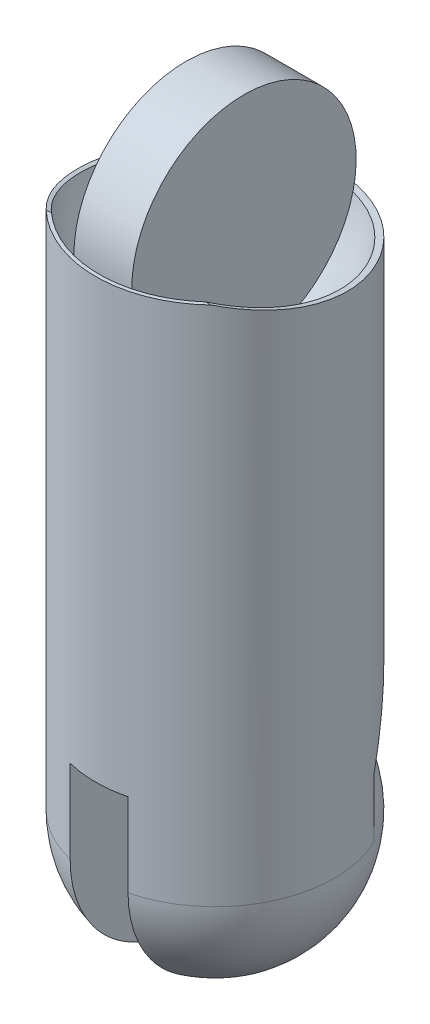
ISO-10303-21;
HEADER;
FILE_DESCRIPTION(('STEP AP214'),'2;1');
FILE_NAME('part.step','',(''),(''),'','','');
FILE_SCHEMA(('AUTOMOTIVE_DESIGN { 1 0 10303 214 1 1 1 1 }'));
ENDSEC;
DATA;
#1=APPLICATION_CONTEXT('core data for automotive mechanical design processes');
#2=APPLICATION_PROTOCOL_DEFINITION('international standard','automotive_design',2000,#1);
#3=PRODUCT_CONTEXT('',#1,'mechanical');
#4=PRODUCT('Part','Part','',(#3));
#5=PRODUCT_RELATED_PRODUCT_CATEGORY('part','',(#4));
#6=PRODUCT_DEFINITION_FORMATION('','',#4);
#7=PRODUCT_DEFINITION_CONTEXT('part definition',#1,'design');
#8=PRODUCT_DEFINITION('design','',#6,#7);
#9=PRODUCT_DEFINITION_SHAPE('','',#8);
#10=(LENGTH_UNIT() NAMED_UNIT(*) SI_UNIT(.MILLI.,.METRE.));
#11=(NAMED_UNIT(*) PLANE_ANGLE_UNIT() SI_UNIT($,.RADIAN.));
#12=(NAMED_UNIT(*) SI_UNIT($,.STERADIAN.) SOLID_ANGLE_UNIT());
#13=UNCERTAINTY_MEASURE_WITH_UNIT(LENGTH_MEASURE(1.E-05),#10,'distance_accuracy_value','');
#14=(GEOMETRIC_REPRESENTATION_CONTEXT(3) GLOBAL_UNCERTAINTY_ASSIGNED_CONTEXT((#13)) GLOBAL_UNIT_ASSIGNED_CONTEXT((#10,
#11,#12)) REPRESENTATION_CONTEXT('',''));
#15=CARTESIAN_POINT('',(0.,0.,0.));
#16=DIRECTION('',(0.,0.,1.));
#17=DIRECTION('',(1.,0.,0.));
#18=AXIS2_PLACEMENT_3D('',#15,#16,#17);
#19=CARTESIAN_POINT('',(0.,36.,0.));
#20=DIRECTION('',(0.,1.,0.));
#21=DIRECTION('',(0.,0.,1.));
#22=AXIS2_PLACEMENT_3D('',#19,#20,#21);
#23=PLANE('',#22);
#24=DIRECTION('',(0.,0.,-1.));
#25=VECTOR('',#24,1.);
#26=CARTESIAN_POINT('',(2.,36.,0.));
#27=LINE('',#26,#25);
#28=CARTESIAN_POINT('',(2.,36.,7.75));
#29=VERTEX_POINT('',#28);
#30=CARTESIAN_POINT('',(2.,36.,7.74596669241483));
#31=VERTEX_POINT('',#30);
#32=EDGE_CURVE('E174',#29,#31,#27,.T.);
#33=ORIENTED_EDGE('',*,*,#32,.F.);
#34=DIRECTION('',(-1.,0.,0.));
#35=VECTOR('',#34,1.);
#36=CARTESIAN_POINT('',(2.,36.,7.75));
#37=LINE('',#36,#35);
#38=CARTESIAN_POINT('',(1.98431348329844,36.,7.75));
#39=VERTEX_POINT('',#38);
#40=EDGE_CURVE('E180',#29,#39,#37,.T.);
#41=ORIENTED_EDGE('',*,*,#40,.T.);
#42=CARTESIAN_POINT('',(0.,36.,0.));
#43=DIRECTION('',(0.,1.,0.));
#44=DIRECTION('',(0.,0.,1.));
#45=AXIS2_PLACEMENT_3D('',#42,#43,#44);
#46=CIRCLE('',#45,8.);
#47=CARTESIAN_POINT('',(-1.98431348329844,36.,7.75));
#48=VERTEX_POINT('',#47);
#49=EDGE_CURVE('E277',#39,#48,#46,.F.);
#50=ORIENTED_EDGE('',*,*,#49,.T.);
#51=CARTESIAN_POINT('',(-2.,36.,7.75));
#52=VERTEX_POINT('',#51);
#53=EDGE_CURVE('E62',#48,#52,#37,.T.);
#54=ORIENTED_EDGE('',*,*,#53,.T.);
#55=DIRECTION('',(0.,0.,-1.));
#56=VECTOR('',#55,1.);
#57=CARTESIAN_POINT('',(-2.,36.,0.));
#58=LINE('',#57,#56);
#59=CARTESIAN_POINT('',(-2.,36.,7.74596669241483));
#60=VERTEX_POINT('',#59);
#61=EDGE_CURVE('E170',#52,#60,#58,.T.);
#62=ORIENTED_EDGE('',*,*,#61,.T.);
#63=CARTESIAN_POINT('',(-5.3215642080525,36.,5.97335369617224));
#64=VERTEX_POINT('',#63);
#65=EDGE_CURVE('E278',#60,#64,#46,.F.);
#66=ORIENTED_EDGE('',*,*,#65,.T.);
#67=DIRECTION('',(1.,0.,0.));
#68=VECTOR('',#67,1.);
#69=CARTESIAN_POINT('',(-15.,36.,5.97335369617224));
#70=LINE('',#69,#68);
#71=CARTESIAN_POINT('',(-5.69047850540053,36.,5.97335369617224));
#72=VERTEX_POINT('',#71);
#73=EDGE_CURVE('E286',#72,#64,#70,.T.);
#74=ORIENTED_EDGE('',*,*,#73,.F.);
#75=CARTESIAN_POINT('',(0.,36.,0.));
#76=DIRECTION('',(0.,1.,0.));
#77=DIRECTION('',(0.,0.,1.));
#78=AXIS2_PLACEMENT_3D('',#75,#76,#77);
#79=CIRCLE('',#78,8.25);
#80=CARTESIAN_POINT('',(5.69047850540053,36.,5.97335369617224));
#81=VERTEX_POINT('',#80);
#82=EDGE_CURVE('E264',#72,#81,#79,.T.);
#83=ORIENTED_EDGE('',*,*,#82,.T.);
#84=CARTESIAN_POINT('',(5.3215642080525,36.,5.97335369617224));
#85=VERTEX_POINT('',#84);
#86=EDGE_CURVE('E187',#85,#81,#70,.T.);
#87=ORIENTED_EDGE('',*,*,#86,.F.);
#88=EDGE_CURVE('E274',#85,#31,#46,.F.);
#89=ORIENTED_EDGE('',*,*,#88,.T.);
#90=EDGE_LOOP('',(#33,#41,#50,#54,#62,#66,#74,#83,#87,#89));
#91=FACE_BOUND('',#90,.T.);
#92=ADVANCED_FACE('F38',(#91),#23,.T.);
#93=CARTESIAN_POINT('',(0.,36.,0.));
#94=DIRECTION('',(-1.,0.,0.));
#95=DIRECTION('',(0.,0.,-1.));
#96=AXIS2_PLACEMENT_3D('',#93,#94,#95);
#97=SPHERICAL_SURFACE('',#96,8.);
#98=CARTESIAN_POINT('',(-5.3215642080525,36.,5.97335369617224));
#99=CARTESIAN_POINT('',(-5.48614232672843,35.9554743726382,5.82676601396653));
#100=CARTESIAN_POINT('',(-5.64422779175355,35.9099547395393,5.67320395136296));
#101=CARTESIAN_POINT('',(-5.94643271531232,35.8177724982267,5.35323956337665));
#102=CARTESIAN_POINT('',(-6.09055318311453,35.7711099729172,5.18683816747294));
#103=CARTESIAN_POINT('',(-6.36377455277162,35.6775135101912,4.84240430487822));
#104=CARTESIAN_POINT('',(-6.49288603709173,35.6305797887997,4.66438017310098));
#105=CARTESIAN_POINT('',(-6.73536791141526,35.5371872758285,4.29780068972347));
#106=CARTESIAN_POINT('',(-6.84873839025181,35.4907284815698,4.1092453975634));
#107=CARTESIAN_POINT('',(-7.05903541360741,35.3989755548127,3.72280865631633));
#108=CARTESIAN_POINT('',(-7.15595559529589,35.3536818786929,3.52492363621524));
#109=CARTESIAN_POINT('',(-7.3326608468633,35.2648947416569,3.12125293679665));
#110=CARTESIAN_POINT('',(-7.41244565399105,35.2214013083535,2.91546713638684));
#111=CARTESIAN_POINT('',(-7.5543303535871,35.1367389099754,2.49747221284557));
#112=CARTESIAN_POINT('',(-7.61643394122213,35.0955694606593,2.28526444210111));
#113=CARTESIAN_POINT('',(-7.72255535633911,35.0159486498448,1.85587591813577));
#114=CARTESIAN_POINT('',(-7.76657325095335,34.9774972782574,1.6386951833772));
#115=CARTESIAN_POINT('',(-7.83623132404941,34.9035831785807,1.20078881496743));
#116=CARTESIAN_POINT('',(-7.86186216836123,34.8681219764971,0.980061438912525));
#117=CARTESIAN_POINT('',(-7.89452129425521,34.8003763969979,0.536672008897593));
#118=CARTESIAN_POINT('',(-7.90154312050155,34.768093125722,0.314009310453586));
#119=CARTESIAN_POINT('',(-7.89689050071743,34.7067910562646,-0.131566931702512));
#120=CARTESIAN_POINT('',(-7.88521629800706,34.6777722156033,-0.354480472112281));
#121=CARTESIAN_POINT('',(-7.84321807404064,34.6229772640787,-0.798948690592373));
#122=CARTESIAN_POINT('',(-7.812893756528,34.5972012047347,-1.02050334702039));
#123=CARTESIAN_POINT('',(-7.73376435351953,34.5487911588448,-1.46063792677904));
#124=CARTESIAN_POINT('',(-7.68495909748851,34.5261572012956,-1.67921782264041));
#125=CARTESIAN_POINT('',(-7.56916097646493,34.4838658600422,-2.11180561117561));
#126=CARTESIAN_POINT('',(-7.50216770425503,34.4642085429982,-2.32581340136735));
#127=CARTESIAN_POINT('',(-7.35043302628892,34.4276625278011,-2.74762587604319));
#128=CARTESIAN_POINT('',(-7.26569599518662,34.4107731490499,-2.9554320751038));
#129=CARTESIAN_POINT('',(-7.07897756267544,34.3795073723028,-3.36343185701755));
#130=CARTESIAN_POINT('',(-6.97699021747909,34.3651318439662,-3.56362278672351));
#131=CARTESIAN_POINT('',(-6.75659542788911,34.3386557042349,-3.95459567680515));
#132=CARTESIAN_POINT('',(-6.6382076533768,34.3265524079909,-4.14538854261159));
#133=CARTESIAN_POINT('',(-6.3857131180601,34.3043363631413,-4.51639979856243));
#134=CARTESIAN_POINT('',(-6.2516062078651,34.2942236334559,-4.69661808818436));
#135=CARTESIAN_POINT('',(-5.96859268619144,34.2757338321316,-5.04512442544404));
#136=CARTESIAN_POINT('',(-5.81968633771177,34.2673567296571,-5.21341268499788));
#137=CARTESIAN_POINT('',(-5.50810177072685,34.2520990440022,-5.53679793893966));
#138=CARTESIAN_POINT('',(-5.34542332119342,34.2452184859334,-5.69189471195177));
#139=CARTESIAN_POINT('',(-5.00853744498597,34.2327782729946,-5.98676067866767));
#140=CARTESIAN_POINT('',(-4.83441153407972,34.227210349661,-6.12662266010951));
#141=CARTESIAN_POINT('',(-4.47485903508568,34.2171501849704,-6.39116106819268));
#142=CARTESIAN_POINT('',(-4.28942855433694,34.2126583168013,-6.51583221914196));
#143=CARTESIAN_POINT('',(-3.90868078034171,34.204594256857,-6.74896797603401));
#144=CARTESIAN_POINT('',(-3.71336564008791,34.201021865832,-6.85743609101845));
#145=CARTESIAN_POINT('',(-3.31420786188942,34.1946635440081,-7.05738072454456));
#146=CARTESIAN_POINT('',(-3.11036515096606,34.1918776199414,-7.14885709763497));
#147=CARTESIAN_POINT('',(-2.69726701635815,34.1870061316698,-7.31347082126215));
#148=CARTESIAN_POINT('',(-2.48806719856934,34.1849151990956,-7.38674758287467));
#149=CARTESIAN_POINT('',(-2.06421135238664,34.1813245094229,-7.51535113303676));
#150=CARTESIAN_POINT('',(-1.84955523194795,34.1798247623043,-7.57067761855812));
#151=CARTESIAN_POINT('',(-1.41637033403342,34.1773597087101,-7.66295705019513));
#152=CARTESIAN_POINT('',(-1.19784232530844,34.1763942973442,-7.69991360218836));
#153=CARTESIAN_POINT('',(-0.758368500671797,34.1749604950742,-7.75520294085446));
#154=CARTESIAN_POINT('',(-0.537421921842376,34.1744922658502,-7.77352966915929));
#155=CARTESIAN_POINT('',(-0.0958489860685957,34.1740366937127,-7.79135800652833));
#156=CARTESIAN_POINT('',(0.124773689599016,34.1740470198345,-7.79095086526969));
#157=CARTESIAN_POINT('',(0.565198857177292,34.1745431790557,-7.77154072027427));
#158=CARTESIAN_POINT('',(0.785001350307136,34.1750290114479,-7.75253774419077));
#159=CARTESIAN_POINT('',(1.22225371291758,34.176494590983,-7.69607213141442));
#160=CARTESIAN_POINT('',(1.43970322726668,34.1774744116494,-7.65860674686153));
#161=CARTESIAN_POINT('',(1.87060013601087,34.1799645539353,-7.56550704538614));
#162=CARTESIAN_POINT('',(2.084048804716,34.1814747035078,-7.50987862125168));
#163=CARTESIAN_POINT('',(2.50540786933669,34.1850816029375,-7.38088947084647));
#164=CARTESIAN_POINT('',(2.71332072919493,34.1871780868752,-7.30753678508657));
#165=CARTESIAN_POINT('',(3.12223693837546,34.1920362805097,-7.14362850050053));
#166=CARTESIAN_POINT('',(3.32324044559628,34.1947979749931,-7.05307329511043));
#167=CARTESIAN_POINT('',(3.7169355223992,34.2010884917176,-6.85542367540495));
#168=CARTESIAN_POINT('',(3.90962694461511,34.2046173275529,-6.74832896801234));
#169=CARTESIAN_POINT('',(4.28534832126745,34.2125688928119,-6.51838976018493));
#170=CARTESIAN_POINT('',(4.46837836976176,34.2169916135312,-6.39554541311996));
#171=CARTESIAN_POINT('',(4.8241426180343,34.2269012866762,-6.13454463413624));
#172=CARTESIAN_POINT('',(4.99683807508998,34.2323919512151,-5.99633553468209));
#173=CARTESIAN_POINT('',(5.32997924212997,34.2446059327671,-5.7060274828054));
#174=CARTESIAN_POINT('',(5.49042905568182,34.2513288342607,-5.55393322121543));
#175=CARTESIAN_POINT('',(5.79808311504547,34.2662151247087,-5.23689588945502));
#176=CARTESIAN_POINT('',(5.94528459859272,34.2743788130201,-5.07195015307752));
#177=CARTESIAN_POINT('',(6.2254126454339,34.2923719689633,-4.73044386070122));
#178=CARTESIAN_POINT('',(6.35833944549205,34.3022014089594,-4.5538834974245));
#179=CARTESIAN_POINT('',(6.60994162679596,34.3238458260356,-4.18912120773809));
#180=CARTESIAN_POINT('',(6.72850793727167,34.3356745403147,-4.00084485738364));
#181=CARTESIAN_POINT('',(6.94948740665735,34.3615231537806,-3.6151869374415));
#182=CARTESIAN_POINT('',(7.05190068928903,34.3755430361827,-3.41780543760833));
#183=CARTESIAN_POINT('',(7.23993336208369,34.4060311775179,-3.01532870589878));
#184=CARTESIAN_POINT('',(7.32554908282469,34.4224999700363,-2.81023180022994));
#185=CARTESIAN_POINT('',(7.47939024422786,34.4581170430998,-2.39392243545951));
#186=CARTESIAN_POINT('',(7.5476215433321,34.4772644176009,-2.18271206334907));
#187=CARTESIAN_POINT('',(7.66676887267495,34.518612491149,-1.75398346140825));
#188=CARTESIAN_POINT('',(7.7175473553082,34.5408355917684,-1.53642915471127));
#189=CARTESIAN_POINT('',(7.80074850143633,34.5883908512898,-1.09817762570586));
#190=CARTESIAN_POINT('',(7.83317147623726,34.6137229574546,-0.87748045676488));
#191=CARTESIAN_POINT('',(7.87947953476857,34.6676041662265,-0.434546981202687));
#192=CARTESIAN_POINT('',(7.89336525576229,34.6961531582086,-0.212310727755291));
#193=CARTESIAN_POINT('',(7.90254019574194,34.756499337626,0.232101157535328));
#194=CARTESIAN_POINT('',(7.89782968979563,34.7882964770092,0.454276790226614));
#195=CARTESIAN_POINT('',(7.86983440816316,34.8551699544616,0.897580749025561));
#196=CARTESIAN_POINT('',(7.84649902850474,34.8902549962633,1.11870456849964));
#197=CARTESIAN_POINT('',(7.78138177862307,34.963453168809,1.55763114373277));
#198=CARTESIAN_POINT('',(7.73960625015545,35.0015652548295,1.77543501463821));
#199=CARTESIAN_POINT('',(7.63787809848795,35.0805741656667,2.20637185164517));
#200=CARTESIAN_POINT('',(7.57791538274475,35.121472526864,2.4195021536655));
#201=CARTESIAN_POINT('',(7.44023363541812,35.2056431130488,2.83945762815249));
#202=CARTESIAN_POINT('',(7.36251518638023,35.2489152601197,3.04628300722428));
#203=CARTESIAN_POINT('',(7.18980295178564,35.3373520543219,3.45228581295944));
#204=CARTESIAN_POINT('',(7.09480130824189,35.3825175550687,3.65145971070144));
#205=CARTESIAN_POINT('',(6.88817635418822,35.4741138373585,4.04068198849475));
#206=CARTESIAN_POINT('',(6.77655342985973,35.5205445894841,4.23073058042919));
#207=CARTESIAN_POINT('',(6.53759303810348,35.6139039582943,4.60014279618733));
#208=CARTESIAN_POINT('',(6.41027791018663,35.6608317822464,4.77952108270813));
#209=CARTESIAN_POINT('',(6.14069011560823,35.7544584049255,5.12660409723144));
#210=CARTESIAN_POINT('',(5.99842527605266,35.8011573102324,5.29431485821594));
#211=CARTESIAN_POINT('',(5.76545264944914,35.8732214664092,5.54611204232562));
#212=CARTESIAN_POINT('',(5.67954082910872,35.8989490897169,5.63457767549595));
#213=CARTESIAN_POINT('',(5.50361373678902,35.9498874344053,5.80719681970841));
#214=CARTESIAN_POINT('',(5.41360498008562,35.9750988900189,5.89135675441042));
#215=CARTESIAN_POINT('',(5.32156420805257,36.,5.97335369617227));
#216=B_SPLINE_CURVE_WITH_KNOTS('',3,(#98,#99,#100,#101,#102,#103,#104,#105,#106,#107,#108,#109,
#110,#111,#112,#113,#114,#115,#116,#117,#118,#119,#120,#121,#122,#123,#124,#125,#126,#127,#128,
#129,#130,#131,#132,#133,#134,#135,#136,#137,#138,#139,#140,#141,#142,#143,#144,#145,#146,#147,
#148,#149,#150,#151,#152,#153,#154,#155,#156,#157,#158,#159,#160,#161,#162,#163,#164,#165,#166,
#167,#168,#169,#170,#171,#172,#173,#174,#175,#176,#177,#178,#179,#180,#181,#182,#183,#184,#185,
#186,#187,#188,#189,#190,#191,#192,#193,#194,#195,#196,#197,#198,#199,#200,#201,#202,#203,#204,
#205,#206,#207,#208,#209,#210,#211,#212,#213,#214,#215),.UNSPECIFIED.,.F.,.F.,(4,2,2,2,2,2,2,2,
2,2,2,2,2,2,2,2,2,2,2,2,2,2,2,2,2,2,2,2,2,2,2,2,2,2,2,2,2,2,2,2,2,2,2,2,2,2,2,2,2,2,2,2,2,2,2,2,
2,2,4),(0.,0.674329101509041,1.34860943196968,2.0224114227971,2.6962096109215,3.37026782727621,
4.04433637879754,4.71826395434584,5.39218902831958,6.06645597813433,6.74095679575364,
7.41544883513085,8.08995158907329,8.76446056722607,9.43898464842253,10.1133426237537,
10.7879334317339,11.4617220621056,12.1355170965095,12.8093001591249,13.4830945267496,
14.1525238401851,14.8221849840725,15.4917008905927,16.1612225279816,16.8254453593008,
17.4896794031375,18.1537830113682,18.8181025152657,19.4791865694316,20.1402696405215,
20.8014511339086,21.462418327411,22.1230862379767,22.783739040333,23.4444035506909,
24.1050616279924,24.7680585351248,25.4308322846564,26.0937439033137,26.7566445250196,
27.4243003791432,28.0919511192077,28.7597475453663,29.4273186297342,30.1000363576631,
30.7727426760807,31.4454258679813,32.1180991098659,32.7926062590876,33.4668816189202,
34.1415318384015,34.8161599265495,35.4910955115512,36.1660154174406,36.8399853668167,
37.5136041925986,37.8913933559136,38.2686013975268),.UNSPECIFIED.);
#217=CARTESIAN_POINT('',(-1.98431348329844,34.1808436778826,-7.53347000230971));
#218=VERTEX_POINT('',#217);
#219=CARTESIAN_POINT('',(1.98431348329844,34.1808436778826,-7.53347000230971));
#220=VERTEX_POINT('',#219);
#221=EDGE_CURVE('E301',#218,#220,#216,.T.);
#222=ORIENTED_EDGE('',*,*,#221,.F.);
#223=CARTESIAN_POINT('',(-1.98431348329844,36.,0.));
#224=DIRECTION('',(1.,0.,0.));
#225=DIRECTION('',(0.,0.,-1.));
#226=AXIS2_PLACEMENT_3D('',#223,#224,#225);
#227=CIRCLE('',#226,7.75);
#228=EDGE_CURVE('E176',#218,#48,#227,.F.);
#229=ORIENTED_EDGE('',*,*,#228,.T.);
#230=ORIENTED_EDGE('',*,*,#49,.F.);
#231=CARTESIAN_POINT('',(1.98431348329844,36.,0.));
#232=DIRECTION('',(-1.,0.,0.));
#233=DIRECTION('',(0.,0.,1.));
#234=AXIS2_PLACEMENT_3D('',#231,#232,#233);
#235=CIRCLE('',#234,7.75);
#236=EDGE_CURVE('E179',#39,#220,#235,.F.);
#237=ORIENTED_EDGE('',*,*,#236,.T.);
#238=EDGE_LOOP('',(#222,#229,#230,#237));
#239=FACE_BOUND('',#238,.T.);
#240=ADVANCED_FACE('F298',(#239),#97,.F.);
#241=ORIENTED_EDGE('',*,*,#65,.F.);
#242=CARTESIAN_POINT('',(-2.,36.,0.));
#243=DIRECTION('',(1.,0.,0.));
#244=DIRECTION('',(0.,0.,-1.));
#245=AXIS2_PLACEMENT_3D('',#242,#243,#244);
#246=CIRCLE('',#245,7.74596669241483);
#247=CARTESIAN_POINT('',(-2.,34.1809563318744,-7.52934792219435));
#248=VERTEX_POINT('',#247);
#249=EDGE_CURVE('E165',#60,#248,#246,.T.);
#250=ORIENTED_EDGE('',*,*,#249,.T.);
#251=EDGE_CURVE('E209',#64,#248,#216,.T.);
#252=ORIENTED_EDGE('',*,*,#251,.F.);
#253=EDGE_LOOP('',(#241,#250,#252));
#254=FACE_BOUND('',#253,.T.);
#255=ADVANCED_FACE('F199',(#254),#97,.F.);
#256=CARTESIAN_POINT('',(-15.,36.,5.97335369617224));
#257=CARTESIAN_POINT('',(-15.,34.6045127277074,1.3780786300688));
#258=CARTESIAN_POINT('',(-15.,34.2749880112108,-3.28186978201098));
#259=CARTESIAN_POINT('',(-15.,34.1630370647498,-8.25));
#260=B_SPLINE_CURVE_WITH_KNOTS('',3,(#256,#257,#258,#259),.UNSPECIFIED.,.F.,.F.,(4,4),(0.,1.),.UNSPECIFIED.);
#261=DIRECTION('',(1.,0.,0.));
#262=VECTOR('',#261,1.);
#263=SURFACE_OF_LINEAR_EXTRUSION('',#260,#262);
#264=DIRECTION('',(1.,0.,0.));
#265=VECTOR('',#264,1.);
#266=CARTESIAN_POINT('',(-0.00130686004544932,34.1808436778826,-7.53347000230971));
#267=LINE('',#266,#265);
#268=CARTESIAN_POINT('',(2.,34.1808436778826,-7.53347000230971));
#269=VERTEX_POINT('',#268);
#270=EDGE_CURVE('E251',#269,#220,#267,.F.);
#271=ORIENTED_EDGE('',*,*,#270,.F.);
#272=CARTESIAN_POINT('',(2.,34.1727295419848,-7.843));
#273=CARTESIAN_POINT('',(2.,34.1883744602429,-7.22221038934706));
#274=CARTESIAN_POINT('',(2.,34.2078481958421,-6.60144694629254));
#275=CARTESIAN_POINT('',(2.,34.2584262579269,-5.35986662421932));
#276=CARTESIAN_POINT('',(2.,34.2895406665812,-4.73905016664768));
#277=CARTESIAN_POINT('',(2.,34.36736823254,-3.49819984539405));
#278=CARTESIAN_POINT('',(2.,34.4140848470776,-2.87816618576209));
#279=CARTESIAN_POINT('',(2.,34.498909587943,-1.94964282572249));
#280=CARTESIAN_POINT('',(2.,34.5296324271786,-1.64047358610697));
#281=CARTESIAN_POINT('',(2.,34.5964980827991,-1.02270032500527));
#282=CARTESIAN_POINT('',(2.,34.6326412659151,-0.714096343194599));
#283=CARTESIAN_POINT('',(2.,34.7400503864883,0.132624690029204));
#284=CARTESIAN_POINT('',(2.,34.817385486573,0.669992627861639));
#285=CARTESIAN_POINT('',(2.,34.992563681013,1.74135250631585));
#286=CARTESIAN_POINT('',(2.,35.0904052606237,2.27534469329338));
#287=CARTESIAN_POINT('',(2.,35.3090767349606,3.3403039906316));
#288=CARTESIAN_POINT('',(2.,35.4299737219941,3.87125749459173));
#289=CARTESIAN_POINT('',(2.,35.6296941608455,4.66314542664058));
#290=CARTESIAN_POINT('',(2.,35.6993494355167,4.92641490551488));
#291=CARTESIAN_POINT('',(2.,35.844933071109,5.45122775972768));
#292=CARTESIAN_POINT('',(2.,35.9208617615066,5.71277104362734));
#293=CARTESIAN_POINT('',(2.,36.,5.97335369617224));
#294=B_SPLINE_CURVE_WITH_KNOTS('',3,(#272,#273,#274,#275,#276,#277,#278,#279,#280,#281,#282,
#283,#284,#285,#286,#287,#288,#289,#290,#291,#292,#293),.UNSPECIFIED.,.F.,.F.,(4,2,2,2,2,2,2,2,
2,2,4),(0.,1.86305310073467,3.72772357057519,5.5928075000499,6.52484173664312,7.45693906155029,
9.08527917987495,10.7134990605557,12.3465315073695,13.1634477722024,13.9804069683515),.UNSPECIFIED.);
#295=CARTESIAN_POINT('',(2.,34.1809563318744,-7.52934792219434));
#296=VERTEX_POINT('',#295);
#297=EDGE_CURVE('E244',#269,#296,#294,.T.);
#298=ORIENTED_EDGE('',*,*,#297,.T.);
#299=EDGE_CURVE('E307',#296,#85,#216,.T.);
#300=ORIENTED_EDGE('',*,*,#299,.T.);
#301=ORIENTED_EDGE('',*,*,#86,.T.);
#302=CARTESIAN_POINT('',(-5.69047850540053,36.,5.97335369617224));
#303=CARTESIAN_POINT('',(-5.86148293183328,35.9505211043281,5.81046720340198));
#304=CARTESIAN_POINT('',(-6.02534435556526,35.9002340494838,5.64034089303209));
#305=CARTESIAN_POINT('',(-6.33780819737861,35.7989650042227,5.28680232720242));
#306=CARTESIAN_POINT('',(-6.48641074250099,35.7479830195956,5.10339018237834));
#307=CARTESIAN_POINT('',(-6.76744267149498,35.6462243787308,4.72439541265823));
#308=CARTESIAN_POINT('',(-6.89986558906778,35.5954478123777,4.52880796865293));
#309=CARTESIAN_POINT('',(-7.1475658911623,35.4949477996712,4.12680690313729));
#310=CARTESIAN_POINT('',(-7.26284353294593,35.4452243375259,3.92039344413231));
#311=CARTESIAN_POINT('',(-7.47548892867619,35.3475291484088,3.49793226199245));
#312=CARTESIAN_POINT('',(-7.57284298832323,35.299558783113,3.28187732769222));
#313=CARTESIAN_POINT('',(-7.74875285856865,35.2060397300117,2.84174094133665));
#314=CARTESIAN_POINT('',(-7.82730909039794,35.1604909879589,2.61765966926878));
#315=CARTESIAN_POINT('',(-7.96490066540164,35.0723474656569,2.16314685748825));
#316=CARTESIAN_POINT('',(-8.02394635920967,35.0297511286219,1.93271875538745));
#317=CARTESIAN_POINT('',(-8.12199756011546,34.9478688373626,1.46705990714161));
#318=CARTESIAN_POINT('',(-8.16100345307558,34.9085828194111,1.23182925355943));
#319=CARTESIAN_POINT('',(-8.21809131136236,34.8341536388732,0.761978232364723));
#320=CARTESIAN_POINT('',(-8.23648761687548,34.7989557909593,0.527404713136666));
#321=CARTESIAN_POINT('',(-8.25315855245261,34.7321332581631,0.057034514164374));
#322=CARTESIAN_POINT('',(-8.25143331077098,34.7005085505069,-0.178762157773933));
#323=CARTESIAN_POINT('',(-8.22774900201447,34.6408377826942,-0.649821152948307));
#324=CARTESIAN_POINT('',(-8.20578754371063,34.6127921459074,-0.885083409741216));
#325=CARTESIAN_POINT('',(-8.14168694066288,34.5601940687362,-1.3532369388307));
#326=CARTESIAN_POINT('',(-8.09954809337765,34.5356415768623,-1.58612824602854));
#327=CARTESIAN_POINT('',(-7.99651662486973,34.4903795578572,-2.04247059539764));
#328=CARTESIAN_POINT('',(-7.93607344886975,34.4695951805938,-2.26601581203369));
#329=CARTESIAN_POINT('',(-7.79651936306065,34.4309780225876,-2.70746620904441));
#330=CARTESIAN_POINT('',(-7.71740834606514,34.4131452587935,-2.92537135702716));
#331=CARTESIAN_POINT('',(-7.54105606224905,34.3801752451673,-3.35390120439271));
#332=CARTESIAN_POINT('',(-7.44381666673771,34.3650377174334,-3.56452665256776));
#333=CARTESIAN_POINT('',(-7.2318734918835,34.3371756055212,-3.9769664600823));
#334=CARTESIAN_POINT('',(-7.11716969470834,34.3244510238065,-4.17878081042483));
#335=CARTESIAN_POINT('',(-6.87180026991332,34.3011940311907,-4.57100324592359));
#336=CARTESIAN_POINT('',(-6.74122840569978,34.2906496505257,-4.76146929039296));
#337=CARTESIAN_POINT('',(-6.46448397287715,34.2713844318251,-5.13090962372631));
#338=CARTESIAN_POINT('',(-6.31830605150587,34.2626642225213,-5.30987993570998));
#339=CARTESIAN_POINT('',(-6.01144268929693,34.2467939311954,-5.65494090140106));
#340=CARTESIAN_POINT('',(-5.85075958386339,34.2396435970498,-5.82103362048626));
#341=CARTESIAN_POINT('',(-5.51599832556964,34.2266755189715,-6.13918438038501));
#342=CARTESIAN_POINT('',(-5.34191993810209,34.2208577983854,-6.29124217528578));
#343=CARTESIAN_POINT('',(-4.98125581076077,34.2103373078712,-6.580511499073));
#344=CARTESIAN_POINT('',(-4.79464676192181,34.2056366940023,-6.7176940452417));
#345=CARTESIAN_POINT('',(-4.41053963044149,34.1971859389574,-6.97590093496296));
#346=CARTESIAN_POINT('',(-4.21304129618798,34.1934358197551,-7.09692490492775));
#347=CARTESIAN_POINT('',(-3.80859685447592,34.1867383221888,-7.32192807932683));
#348=CARTESIAN_POINT('',(-3.60165245990469,34.1837907989571,-7.42591035841596));
#349=CARTESIAN_POINT('',(-3.17967642761335,34.1785772587114,-7.6161499567733));
#350=CARTESIAN_POINT('',(-2.9646420132235,34.1763114781318,-7.70240112345775));
#351=CARTESIAN_POINT('',(-2.52780613019587,34.1723675564485,-7.8566159879996));
#352=CARTESIAN_POINT('',(-2.30599657278184,34.1706901501921,-7.92455679286983));
#353=CARTESIAN_POINT('',(-1.85743747073735,34.1678580154454,-8.04152653915916));
#354=CARTESIAN_POINT('',(-1.63068781933851,34.1667032982636,-8.09055507140527));
#355=CARTESIAN_POINT('',(-1.17386799772583,34.1648694832178,-8.16934857741709));
#356=CARTESIAN_POINT('',(-0.943797884367333,34.1641903772199,-8.19911388062251));
#357=CARTESIAN_POINT('',(-0.481962917348539,34.1632802228689,-8.23917088806048));
#358=CARTESIAN_POINT('',(-0.250198028423217,34.1630491838661,-8.24946218591222));
#359=CARTESIAN_POINT('',(0.21346108831673,34.163025867199,-8.25049691720463));
#360=CARTESIAN_POINT('',(0.445355332286519,34.1632337516115,-8.24123312974048));
#361=CARTESIAN_POINT('',(0.907539001653517,34.1640970004492,-8.2032089988692));
#362=CARTESIAN_POINT('',(1.13782842685773,34.1647523649283,-8.1744486531174));
#363=CARTESIAN_POINT('',(1.5951676475232,34.1665371536019,-8.09763580024701));
#364=CARTESIAN_POINT('',(1.8222174095225,34.1676665826893,-8.04958309400991));
#365=CARTESIAN_POINT('',(2.27145577458119,34.1704455854463,-7.93452901338519));
#366=CARTESIAN_POINT('',(2.4936444796993,34.1720951481844,-7.86752803723186));
#367=CARTESIAN_POINT('',(2.93159270465135,34.1759822377903,-7.71505202813575));
#368=CARTESIAN_POINT('',(3.14735201749774,34.1782197835649,-7.62957640115054));
#369=CARTESIAN_POINT('',(3.57089466153666,34.1833747119158,-7.44076405816452));
#370=CARTESIAN_POINT('',(3.77867816243764,34.1862920800175,-7.33742772245967));
#371=CARTESIAN_POINT('',(4.18483420457106,34.1929260893429,-7.11360929162355));
#372=CARTESIAN_POINT('',(4.3832049492188,34.1966428824076,-6.99312394072338));
#373=CARTESIAN_POINT('',(4.76901355989301,34.2050219229654,-6.73592906259697));
#374=CARTESIAN_POINT('',(4.95645519636067,34.2096838418841,-6.59922518060093));
#375=CARTESIAN_POINT('',(5.31912255010912,34.2201315438482,-6.31055800801884));
#376=CARTESIAN_POINT('',(5.4943498293395,34.2259171828346,-6.15859667461519));
#377=CARTESIAN_POINT('',(5.83136353019709,34.2388211832088,-5.84049566179309));
#378=CARTESIAN_POINT('',(5.99315026788883,34.2459395132445,-5.67435631596771));
#379=CARTESIAN_POINT('',(6.30213575649217,34.261746009531,-5.32909503252579));
#380=CARTESIAN_POINT('',(6.44933456373407,34.2704341697198,-5.14997314504504));
#381=CARTESIAN_POINT('',(6.72809690788225,34.2896412987533,-4.78004698639898));
#382=CARTESIAN_POINT('',(6.85966072654558,34.3001602345974,-4.5892429258512));
#383=CARTESIAN_POINT('',(7.1060844030842,34.3232938006355,-4.19756326552898));
#384=CARTESIAN_POINT('',(7.22096322058623,34.3359060166837,-3.99669945170794));
#385=CARTESIAN_POINT('',(7.4333534015477,34.3635134048637,-3.58624221665903));
#386=CARTESIAN_POINT('',(7.53087121299259,34.3785076883488,-3.37665207228036));
#387=CARTESIAN_POINT('',(7.70794164431604,34.411163812164,-2.95016250555841));
#388=CARTESIAN_POINT('',(7.78749036139514,34.4288262306123,-2.73326150706705));
#389=CARTESIAN_POINT('',(7.9280673411696,34.4670728939031,-2.29378992467302));
#390=CARTESIAN_POINT('',(7.98909563598981,34.4876571336773,-2.07121935060533));
#391=CARTESIAN_POINT('',(8.09214727051027,34.5319204968067,-1.62250868538808));
#392=CARTESIAN_POINT('',(8.13420929162166,34.5555931929214,-1.39637684177828));
#393=CARTESIAN_POINT('',(8.19928818466149,34.6062277299998,-0.941754932150622));
#394=CARTESIAN_POINT('',(8.22230512312241,34.6331895594728,-0.713264874373817));
#395=CARTESIAN_POINT('',(8.24922249112995,34.6904851172186,-0.255640722553575));
#396=CARTESIAN_POINT('',(8.2531275517555,34.7208180268088,-0.0265067979943708));
#397=CARTESIAN_POINT('',(8.2419180838863,34.7848639127734,0.430820386836811));
#398=CARTESIAN_POINT('',(8.22680343198775,34.8185769110773,0.659013640995888));
#399=CARTESIAN_POINT('',(8.17768610981066,34.8894280449025,1.11375924364786));
#400=CARTESIAN_POINT('',(8.14360856493347,34.9265792683009,1.34030145776825));
#401=CARTESIAN_POINT('',(8.05688126397969,35.0039877433463,1.78925590762392));
#402=CARTESIAN_POINT('',(8.00423168262043,35.0442449657707,2.01166818219109));
#403=CARTESIAN_POINT('',(7.88080451054825,35.1275794898512,2.45102440895331));
#404=CARTESIAN_POINT('',(7.81001501407607,35.1706586297392,2.66796466659223));
#405=CARTESIAN_POINT('',(7.65091150472651,35.2591897768104,3.09482555876695));
#406=CARTESIAN_POINT('',(7.56259637050496,35.3046419356895,3.30474574313209));
#407=CARTESIAN_POINT('',(7.35743055971993,35.4029893673194,3.74107183117418));
#408=CARTESIAN_POINT('',(7.23842316310713,35.456121294209,3.96641360362125));
#409=CARTESIAN_POINT('',(6.98025931633336,35.5638246335709,4.40491057810364));
#410=CARTESIAN_POINT('',(6.84109995217661,35.6183962532892,4.61806401146391));
#411=CARTESIAN_POINT('',(6.54366644458195,35.7279941148206,5.0306679517167));
#412=CARTESIAN_POINT('',(6.38538099129738,35.7830206075225,5.23011024035091));
#413=CARTESIAN_POINT('',(6.05099195433357,35.8923431630242,5.61362656677479));
#414=CARTESIAN_POINT('',(5.87489032784437,35.9466393053156,5.79770228860767));
#415=CARTESIAN_POINT('',(5.69047850540052,36.,5.97335369617224));
#416=B_SPLINE_CURVE_WITH_KNOTS('',3,(#302,#303,#304,#305,#306,#307,#308,#309,#310,#311,#312,
#313,#314,#315,#316,#317,#318,#319,#320,#321,#322,#323,#324,#325,#326,#327,#328,#329,#330,#331,
#332,#333,#334,#335,#336,#337,#338,#339,#340,#341,#342,#343,#344,#345,#346,#347,#348,#349,#350,
#351,#352,#353,#354,#355,#356,#357,#358,#359,#360,#361,#362,#363,#364,#365,#366,#367,#368,#369,
#370,#371,#372,#373,#374,#375,#376,#377,#378,#379,#380,#381,#382,#383,#384,#385,#386,#387,#388,
#389,#390,#391,#392,#393,#394,#395,#396,#397,#398,#399,#400,#401,#402,#403,#404,#405,#406,#407,
#408,#409,#410,#411,#412,#413,#414,#415),.UNSPECIFIED.,.F.,.F.,(4,2,2,2,2,2,2,2,2,2,2,2,2,2,2,2,
2,2,2,2,2,2,2,2,2,2,2,2,2,2,2,2,2,2,2,2,2,2,2,2,2,2,2,2,2,2,2,2,2,2,2,2,2,2,2,2,4),(0.,
0.723654994398901,1.44730396336723,2.17124120409311,2.89516758116957,3.61964479077571,
4.34410576442217,5.06818178125239,5.79224385562039,6.50510535248824,7.21796230559324,
7.93090350482295,8.64383419406978,9.34051165949612,10.0371931251794,10.7338027154151,
11.4304130169392,12.12309080317,12.8160069407265,13.5088117137691,14.2016286234801,
14.8957720300669,15.5899314825352,16.2839655568404,16.978240051589,17.6733785952662,
18.3685321776425,19.0636738711893,19.7588300706957,20.4542430082694,21.1496560294741,
21.8450762282961,22.5404818126131,23.2359097606491,23.931322903233,24.6268682476935,
25.3221721981049,26.0173870705835,26.7125855899265,27.4077814247037,28.1029647295053,
28.797351791946,29.4914804142281,30.1857596532036,30.8800376879007,31.5728932772336,
32.2657464461204,32.9584317185477,33.6511214852822,34.3465659319868,35.0420038364384,
35.7378993515271,36.4338394065147,37.2136925924621,37.993658658816,38.7740882212745,
39.554432142794),.UNSPECIFIED.);
#417=EDGE_CURVE('E218',#72,#81,#416,.T.);
#418=ORIENTED_EDGE('',*,*,#417,.F.);
#419=ORIENTED_EDGE('',*,*,#73,.T.);
#420=ORIENTED_EDGE('',*,*,#251,.T.);
#421=CARTESIAN_POINT('',(-2.,34.1727295419848,-7.843));
#422=CARTESIAN_POINT('',(-2.,34.1883744602429,-7.22221038934706));
#423=CARTESIAN_POINT('',(-2.,34.2078481958421,-6.60144694629254));
#424=CARTESIAN_POINT('',(-2.,34.2584262579269,-5.35986662421932));
#425=CARTESIAN_POINT('',(-2.,34.2895406665812,-4.73905016664768));
#426=CARTESIAN_POINT('',(-2.,34.36736823254,-3.49819984539405));
#427=CARTESIAN_POINT('',(-2.,34.4140848470776,-2.87816618576209));
#428=CARTESIAN_POINT('',(-2.,34.498909587943,-1.94964282572249));
#429=CARTESIAN_POINT('',(-2.,34.5296324271786,-1.64047358610697));
#430=CARTESIAN_POINT('',(-2.,34.5964980827991,-1.02270032500527));
#431=CARTESIAN_POINT('',(-2.,34.6326412659151,-0.714096343194599));
#432=CARTESIAN_POINT('',(-2.,34.7400503864883,0.132624690029204));
#433=CARTESIAN_POINT('',(-2.,34.817385486573,0.669992627861639));
#434=CARTESIAN_POINT('',(-2.,34.992563681013,1.74135250631585));
#435=CARTESIAN_POINT('',(-2.,35.0904052606237,2.27534469329338));
#436=CARTESIAN_POINT('',(-2.,35.3090767349606,3.3403039906316));
#437=CARTESIAN_POINT('',(-2.,35.4299737219941,3.87125749459173));
#438=CARTESIAN_POINT('',(-2.,35.6296941608455,4.66314542664058));
#439=CARTESIAN_POINT('',(-2.,35.6993494355167,4.92641490551488));
#440=CARTESIAN_POINT('',(-2.,35.844933071109,5.45122775972768));
#441=CARTESIAN_POINT('',(-2.,35.9208617615066,5.71277104362734));
#442=CARTESIAN_POINT('',(-2.,36.,5.97335369617224));
#443=B_SPLINE_CURVE_WITH_KNOTS('',3,(#421,#422,#423,#424,#425,#426,#427,#428,#429,#430,#431,
#432,#433,#434,#435,#436,#437,#438,#439,#440,#441,#442),.UNSPECIFIED.,.F.,.F.,(4,2,2,2,2,2,2,2,
2,2,4),(0.,1.86305310073467,3.72772357057519,5.5928075000499,6.52484173664312,7.45693906155029,
9.08527917987495,10.7134990605557,12.3465315073695,13.1634477722024,13.9804069683515),.UNSPECIFIED.);
#444=CARTESIAN_POINT('',(-2.,34.1808436778826,-7.5334700023097));
#445=VERTEX_POINT('',#444);
#446=EDGE_CURVE('E224',#445,#248,#443,.T.);
#447=ORIENTED_EDGE('',*,*,#446,.F.);
#448=EDGE_CURVE('E231',#218,#445,#267,.F.);
#449=ORIENTED_EDGE('',*,*,#448,.F.);
#450=ORIENTED_EDGE('',*,*,#221,.T.);
#451=EDGE_LOOP('',(#271,#298,#300,#301,#418,#419,#420,#447,#449,#450));
#452=FACE_BOUND('',#451,.T.);
#453=ADVANCED_FACE('F193',(#452),#263,.F.);
#454=CARTESIAN_POINT('',(-18.,0.,-3.5));
#455=DIRECTION('',(0.,0.,1.));
#456=DIRECTION('',(1.,0.,0.));
#457=AXIS2_PLACEMENT_3D('',#454,#455,#456);
#458=PLANE('',#457);
#459=CARTESIAN_POINT('',(0.,0.,-3.5));
#460=DIRECTION('',(0.,0.,1.));
#461=DIRECTION('',(1.,0.,0.));
#462=AXIS2_PLACEMENT_3D('',#459,#460,#461);
#463=CIRCLE('',#462,7.47077639874197);
#464=CARTESIAN_POINT('',(-7.47077639874197,0.,-3.5));
#465=VERTEX_POINT('',#464);
#466=CARTESIAN_POINT('',(-6.30971473206198,4.,-3.5));
#467=VERTEX_POINT('',#466);
#468=EDGE_CURVE('E273',#465,#467,#463,.F.);
#469=ORIENTED_EDGE('',*,*,#468,.F.);
#470=DIRECTION('',(0.,-1.,0.));
#471=VECTOR('',#470,1.);
#472=CARTESIAN_POINT('',(-7.47077639874197,36.,-3.5));
#473=LINE('',#472,#471);
#474=CARTESIAN_POINT('',(-7.47077639874197,4.,-3.5));
#475=VERTEX_POINT('',#474);
#476=EDGE_CURVE('E262',#475,#465,#473,.T.);
#477=ORIENTED_EDGE('',*,*,#476,.F.);
#478=DIRECTION('',(1.,0.,0.));
#479=VECTOR('',#478,1.);
#480=CARTESIAN_POINT('',(-18.,4.,-3.5));
#481=LINE('',#480,#479);
#482=EDGE_CURVE('E313',#475,#467,#481,.T.);
#483=ORIENTED_EDGE('',*,*,#482,.T.);
#484=EDGE_LOOP('',(#469,#477,#483));
#485=FACE_BOUND('',#484,.T.);
#486=ADVANCED_FACE('F198',(#485),#458,.F.);
#487=CARTESIAN_POINT('',(0.,36.,0.));
#488=DIRECTION('',(0.,-1.,0.));
#489=DIRECTION('',(0.,0.,-1.));
#490=AXIS2_PLACEMENT_3D('',#487,#488,#489);
#491=CYLINDRICAL_SURFACE('',#490,8.25);
#492=ORIENTED_EDGE('',*,*,#82,.F.);
#493=ORIENTED_EDGE('',*,*,#417,.T.);
#494=EDGE_LOOP('',(#492,#493));
#495=FACE_BOUND('',#494,.T.);
#496=CARTESIAN_POINT('',(0.,0.,0.));
#497=DIRECTION('',(0.,1.,0.));
#498=DIRECTION('',(0.,0.,1.));
#499=AXIS2_PLACEMENT_3D('',#496,#497,#498);
#500=CIRCLE('',#499,8.25);
#501=CARTESIAN_POINT('',(-2.,0.,8.00390529679106));
#502=VERTEX_POINT('',#501);
#503=EDGE_CURVE('E261',#465,#502,#500,.T.);
#504=ORIENTED_EDGE('',*,*,#503,.T.);
#505=DIRECTION('',(0.,-1.,0.));
#506=VECTOR('',#505,1.);
#507=CARTESIAN_POINT('',(-2.,36.,8.00390529679106));
#508=LINE('',#507,#506);
#509=CARTESIAN_POINT('',(-2.,5.75,8.00390529679106));
#510=VERTEX_POINT('',#509);
#511=EDGE_CURVE('E157',#502,#510,#508,.F.);
#512=ORIENTED_EDGE('',*,*,#511,.T.);
#513=CARTESIAN_POINT('',(0.,5.75,0.));
#514=DIRECTION('',(0.,1.,0.));
#515=DIRECTION('',(0.,0.,1.));
#516=AXIS2_PLACEMENT_3D('',#513,#514,#515);
#517=CIRCLE('',#516,8.25);
#518=CARTESIAN_POINT('',(2.,5.75,8.00390529679106));
#519=VERTEX_POINT('',#518);
#520=EDGE_CURVE('E146',#510,#519,#517,.T.);
#521=ORIENTED_EDGE('',*,*,#520,.T.);
#522=DIRECTION('',(0.,-1.,0.));
#523=VECTOR('',#522,1.);
#524=CARTESIAN_POINT('',(2.,36.,8.00390529679106));
#525=LINE('',#524,#523);
#526=CARTESIAN_POINT('',(2.,0.,8.00390529679106));
#527=VERTEX_POINT('',#526);
#528=EDGE_CURVE('E139',#519,#527,#525,.T.);
#529=ORIENTED_EDGE('',*,*,#528,.T.);
#530=CARTESIAN_POINT('',(7.47077639874197,0.,-3.5));
#531=VERTEX_POINT('',#530);
#532=EDGE_CURVE('E256',#527,#531,#500,.T.);
#533=ORIENTED_EDGE('',*,*,#532,.T.);
#534=DIRECTION('',(0.,-1.,0.));
#535=VECTOR('',#534,1.);
#536=CARTESIAN_POINT('',(7.47077639874197,36.,-3.5));
#537=LINE('',#536,#535);
#538=CARTESIAN_POINT('',(7.47077639874196,4.,-3.5));
#539=VERTEX_POINT('',#538);
#540=EDGE_CURVE('E266',#531,#539,#537,.F.);
#541=ORIENTED_EDGE('',*,*,#540,.T.);
#542=CARTESIAN_POINT('',(0.,-3.36842105263158,0.));
#543=DIRECTION('',(0.,0.429056814568288,0.90327750435429));
#544=DIRECTION('',(0.,-0.90327750435429,0.429056814568288));
#545=AXIS2_PLACEMENT_3D('',#542,#543,#544);
#546=ELLIPSE('',#545,19.2282227431839,8.25);
#547=EDGE_CURVE('E270',#539,#475,#546,.T.);
#548=ORIENTED_EDGE('',*,*,#547,.T.);
#549=ORIENTED_EDGE('',*,*,#476,.T.);
#550=EDGE_LOOP('',(#504,#512,#521,#529,#533,#541,#548,#549));
#551=FACE_BOUND('',#550,.T.);
#552=ADVANCED_FACE('F40',(#495,#551),#491,.T.);
#553=CARTESIAN_POINT('',(-18.,4.,-3.5));
#554=DIRECTION('',(0.,0.429056814568288,0.90327750435429));
#555=DIRECTION('',(0.,-0.90327750435429,0.429056814568288));
#556=AXIS2_PLACEMENT_3D('',#553,#554,#555);
#557=PLANE('',#556);
#558=CARTESIAN_POINT('',(0.,-0.62009178990311,-1.30545639979602));
#559=DIRECTION('',(0.,0.429056814568288,0.90327750435429));
#560=DIRECTION('',(0.,-0.90327750435429,0.429056814568288));
#561=AXIS2_PLACEMENT_3D('',#558,#559,#560);
#562=CIRCLE('',#561,8.12242388455111);
#563=CARTESIAN_POINT('',(6.30971473206198,4.,-3.5));
#564=VERTEX_POINT('',#563);
#565=EDGE_CURVE('E276',#467,#564,#562,.F.);
#566=ORIENTED_EDGE('',*,*,#565,.F.);
#567=ORIENTED_EDGE('',*,*,#482,.F.);
#568=ORIENTED_EDGE('',*,*,#547,.F.);
#569=EDGE_CURVE('E282',#564,#539,#481,.T.);
#570=ORIENTED_EDGE('',*,*,#569,.F.);
#571=EDGE_LOOP('',(#566,#567,#568,#570));
#572=FACE_BOUND('',#571,.T.);
#573=ADVANCED_FACE('F317',(#572),#557,.F.);
#574=EDGE_CURVE('E258',#564,#531,#463,.F.);
#575=ORIENTED_EDGE('',*,*,#574,.F.);
#576=ORIENTED_EDGE('',*,*,#569,.T.);
#577=ORIENTED_EDGE('',*,*,#540,.F.);
#578=EDGE_LOOP('',(#575,#576,#577));
#579=FACE_BOUND('',#578,.T.);
#580=ADVANCED_FACE('F321',(#579),#458,.F.);
#581=CARTESIAN_POINT('',(0.,0.,0.));
#582=DIRECTION('',(0.,1.,0.));
#583=DIRECTION('',(0.,0.,-1.));
#584=AXIS2_PLACEMENT_3D('',#581,#582,#583);
#585=SPHERICAL_SURFACE('',#584,8.25);
#586=CARTESIAN_POINT('',(0.,5.75,0.));
#587=DIRECTION('',(0.,1.,0.));
#588=DIRECTION('',(0.,0.,1.));
#589=AXIS2_PLACEMENT_3D('',#586,#587,#588);
#590=CIRCLE('',#589,5.91607978309962);
#591=CARTESIAN_POINT('',(2.,5.75,-5.56776436283003));
#592=VERTEX_POINT('',#591);
#593=CARTESIAN_POINT('',(-2.,5.75,-5.56776436283002));
#594=VERTEX_POINT('',#593);
#595=EDGE_CURVE('E47',#592,#594,#590,.T.);
#596=ORIENTED_EDGE('',*,*,#595,.T.);
#597=CARTESIAN_POINT('',(-2.,0.,0.));
#598=DIRECTION('',(-1.,0.,0.));
#599=DIRECTION('',(0.,0.,1.));
#600=AXIS2_PLACEMENT_3D('',#597,#598,#599);
#601=CIRCLE('',#600,8.00390529679106);
#602=EDGE_CURVE('E11',#594,#502,#601,.T.);
#603=ORIENTED_EDGE('',*,*,#602,.T.);
#604=ORIENTED_EDGE('',*,*,#503,.F.);
#605=ORIENTED_EDGE('',*,*,#468,.T.);
#606=ORIENTED_EDGE('',*,*,#565,.T.);
#607=ORIENTED_EDGE('',*,*,#574,.T.);
#608=ORIENTED_EDGE('',*,*,#532,.F.);
#609=CARTESIAN_POINT('',(2.,0.,0.));
#610=DIRECTION('',(1.,0.,0.));
#611=DIRECTION('',(0.,0.,-1.));
#612=AXIS2_PLACEMENT_3D('',#609,#610,#611);
#613=CIRCLE('',#612,8.00390529679106);
#614=EDGE_CURVE('E142',#527,#592,#613,.T.);
#615=ORIENTED_EDGE('',*,*,#614,.T.);
#616=EDGE_LOOP('',(#596,#603,#604,#605,#606,#607,#608,#615));
#617=FACE_BOUND('',#616,.T.);
#618=ADVANCED_FACE('F253',(#617),#585,.T.);
#619=CARTESIAN_POINT('',(2.,36.,0.));
#620=DIRECTION('',(1.,0.,0.));
#621=DIRECTION('',(0.,0.,-1.));
#622=AXIS2_PLACEMENT_3D('',#619,#620,#621);
#623=CIRCLE('',#622,7.74596669241483);
#624=EDGE_CURVE('E172',#31,#296,#623,.T.);
#625=ORIENTED_EDGE('',*,*,#624,.F.);
#626=ORIENTED_EDGE('',*,*,#88,.F.);
#627=ORIENTED_EDGE('',*,*,#299,.F.);
#628=EDGE_LOOP('',(#625,#626,#627));
#629=FACE_BOUND('',#628,.T.);
#630=ADVANCED_FACE('F203',(#629),#97,.F.);
#631=CARTESIAN_POINT('',(2.,36.,0.));
#632=DIRECTION('',(-1.,0.,0.));
#633=DIRECTION('',(0.,0.,1.));
#634=AXIS2_PLACEMENT_3D('',#631,#632,#633);
#635=CYLINDRICAL_SURFACE('',#634,7.75);
#636=ORIENTED_EDGE('',*,*,#40,.F.);
#637=CARTESIAN_POINT('',(2.,36.,0.));
#638=DIRECTION('',(1.,0.,0.));
#639=DIRECTION('',(0.,0.,-1.));
#640=AXIS2_PLACEMENT_3D('',#637,#638,#639);
#641=CIRCLE('',#640,7.75);
#642=EDGE_CURVE('E162',#269,#29,#641,.T.);
#643=ORIENTED_EDGE('',*,*,#642,.F.);
#644=ORIENTED_EDGE('',*,*,#270,.T.);
#645=ORIENTED_EDGE('',*,*,#236,.F.);
#646=EDGE_LOOP('',(#636,#643,#644,#645));
#647=FACE_BOUND('',#646,.T.);
#648=ORIENTED_EDGE('',*,*,#53,.F.);
#649=ORIENTED_EDGE('',*,*,#228,.F.);
#650=ORIENTED_EDGE('',*,*,#448,.T.);
#651=CARTESIAN_POINT('',(-2.,36.,0.));
#652=DIRECTION('',(1.,0.,0.));
#653=DIRECTION('',(0.,0.,-1.));
#654=AXIS2_PLACEMENT_3D('',#651,#652,#653);
#655=CIRCLE('',#654,7.75);
#656=EDGE_CURVE('E159',#445,#52,#655,.T.);
#657=ORIENTED_EDGE('',*,*,#656,.T.);
#658=EDGE_LOOP('',(#648,#649,#650,#657));
#659=FACE_BOUND('',#658,.T.);
#660=ADVANCED_FACE('F201',(#647,#659),#635,.T.);
#661=CARTESIAN_POINT('',(2.,36.,0.));
#662=DIRECTION('',(1.,0.,0.));
#663=DIRECTION('',(0.,0.,-1.));
#664=AXIS2_PLACEMENT_3D('',#661,#662,#663);
#665=PLANE('',#664);
#666=ORIENTED_EDGE('',*,*,#642,.T.);
#667=ORIENTED_EDGE('',*,*,#32,.T.);
#668=ORIENTED_EDGE('',*,*,#624,.T.);
#669=ORIENTED_EDGE('',*,*,#297,.F.);
#670=EDGE_LOOP('',(#666,#667,#668,#669));
#671=FACE_BOUND('',#670,.T.);
#672=ADVANCED_FACE('F237',(#671),#665,.T.);
#673=CARTESIAN_POINT('',(-2.,36.,0.));
#674=DIRECTION('',(1.,0.,0.));
#675=DIRECTION('',(0.,0.,-1.));
#676=AXIS2_PLACEMENT_3D('',#673,#674,#675);
#677=PLANE('',#676);
#678=ORIENTED_EDGE('',*,*,#61,.F.);
#679=ORIENTED_EDGE('',*,*,#656,.F.);
#680=ORIENTED_EDGE('',*,*,#446,.T.);
#681=ORIENTED_EDGE('',*,*,#249,.F.);
#682=EDGE_LOOP('',(#678,#679,#680,#681));
#683=FACE_BOUND('',#682,.T.);
#684=ADVANCED_FACE('F232',(#683),#677,.F.);
#685=CARTESIAN_POINT('',(-2.,-8.25,-15.));
#686=DIRECTION('',(-1.,0.,0.));
#687=DIRECTION('',(0.,0.,1.));
#688=AXIS2_PLACEMENT_3D('',#685,#686,#687);
#689=PLANE('',#688);
#690=ORIENTED_EDGE('',*,*,#602,.F.);
#691=DIRECTION('',(0.,0.,1.));
#692=VECTOR('',#691,1.);
#693=CARTESIAN_POINT('',(-2.,5.75,-15.));
#694=LINE('',#693,#692);
#695=EDGE_CURVE('E147',#594,#510,#694,.T.);
#696=ORIENTED_EDGE('',*,*,#695,.T.);
#697=ORIENTED_EDGE('',*,*,#511,.F.);
#698=EDGE_LOOP('',(#690,#696,#697));
#699=FACE_BOUND('',#698,.T.);
#700=ADVANCED_FACE('F236',(#699),#689,.F.);
#701=CARTESIAN_POINT('',(-2.,5.75,-15.));
#702=DIRECTION('',(0.,1.,0.));
#703=DIRECTION('',(0.,0.,1.));
#704=AXIS2_PLACEMENT_3D('',#701,#702,#703);
#705=PLANE('',#704);
#706=ORIENTED_EDGE('',*,*,#695,.F.);
#707=ORIENTED_EDGE('',*,*,#595,.F.);
#708=DIRECTION('',(0.,0.,1.));
#709=VECTOR('',#708,1.);
#710=CARTESIAN_POINT('',(2.,5.75,-15.));
#711=LINE('',#710,#709);
#712=EDGE_CURVE('E54',#592,#519,#711,.T.);
#713=ORIENTED_EDGE('',*,*,#712,.T.);
#714=ORIENTED_EDGE('',*,*,#520,.F.);
#715=EDGE_LOOP('',(#706,#707,#713,#714));
#716=FACE_BOUND('',#715,.T.);
#717=ADVANCED_FACE('F151',(#716),#705,.F.);
#718=CARTESIAN_POINT('',(2.,5.75,-15.));
#719=DIRECTION('',(1.,0.,0.));
#720=DIRECTION('',(0.,0.,-1.));
#721=AXIS2_PLACEMENT_3D('',#718,#719,#720);
#722=PLANE('',#721);
#723=ORIENTED_EDGE('',*,*,#712,.F.);
#724=ORIENTED_EDGE('',*,*,#614,.F.);
#725=ORIENTED_EDGE('',*,*,#528,.F.);
#726=EDGE_LOOP('',(#723,#724,#725));
#727=FACE_BOUND('',#726,.T.);
#728=ADVANCED_FACE('F140',(#727),#722,.F.);
#729=CLOSED_SHELL('',(#92,#240,#255,#453,#486,#552,#573,#580,#618,#630,#660,#672,#684,#700,#717,#728));
#730=MANIFOLD_SOLID_BREP('B2',#729);
#731=ADVANCED_BREP_SHAPE_REPRESENTATION('',(#18,#730),#14);
#732=SHAPE_DEFINITION_REPRESENTATION(#9,#731);
ENDSEC;
END-ISO-10303-21;
